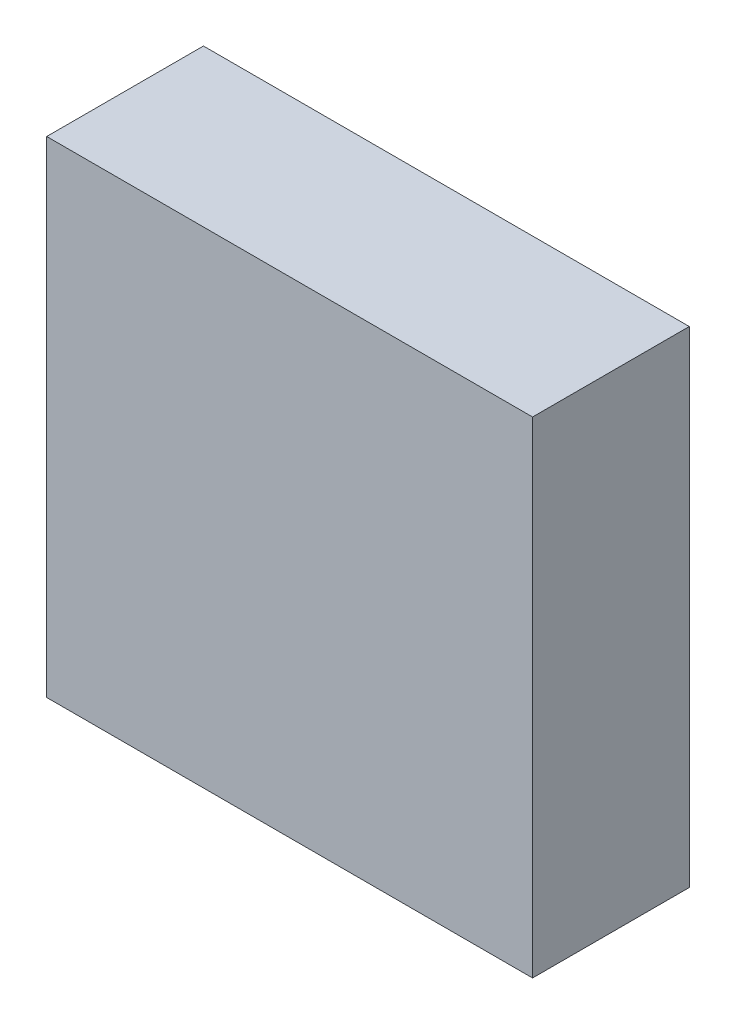
ISO-10303-21;
HEADER;
FILE_DESCRIPTION(('STEP AP214'),'2;1');
FILE_NAME('part.step','',(''),(''),'','','');
FILE_SCHEMA(('AUTOMOTIVE_DESIGN { 1 0 10303 214 1 1 1 1 }'));
ENDSEC;
DATA;
#1=APPLICATION_CONTEXT('core data for automotive mechanical design processes');
#2=APPLICATION_PROTOCOL_DEFINITION('international standard','automotive_design',2000,#1);
#3=PRODUCT_CONTEXT('',#1,'mechanical');
#4=PRODUCT('Part','Part','',(#3));
#5=PRODUCT_RELATED_PRODUCT_CATEGORY('part','',(#4));
#6=PRODUCT_DEFINITION_FORMATION('','',#4);
#7=PRODUCT_DEFINITION_CONTEXT('part definition',#1,'design');
#8=PRODUCT_DEFINITION('design','',#6,#7);
#9=PRODUCT_DEFINITION_SHAPE('','',#8);
#10=(LENGTH_UNIT() NAMED_UNIT(*) SI_UNIT(.MILLI.,.METRE.));
#11=(NAMED_UNIT(*) PLANE_ANGLE_UNIT() SI_UNIT($,.RADIAN.));
#12=(NAMED_UNIT(*) SI_UNIT($,.STERADIAN.) SOLID_ANGLE_UNIT());
#13=UNCERTAINTY_MEASURE_WITH_UNIT(LENGTH_MEASURE(1.E-05),#10,'distance_accuracy_value','');
#14=(GEOMETRIC_REPRESENTATION_CONTEXT(3) GLOBAL_UNCERTAINTY_ASSIGNED_CONTEXT((#13)) GLOBAL_UNIT_ASSIGNED_CONTEXT((#10,
#11,#12)) REPRESENTATION_CONTEXT('',''));
#15=CARTESIAN_POINT('',(0.,0.,0.));
#16=DIRECTION('',(0.,0.,1.));
#17=DIRECTION('',(1.,0.,0.));
#18=AXIS2_PLACEMENT_3D('',#15,#16,#17);
#19=CARTESIAN_POINT('',(-1.5500096,1.5500223,1.00000054));
#20=DIRECTION('',(0.,0.,1.));
#21=DIRECTION('',(1.,0.,0.));
#22=AXIS2_PLACEMENT_3D('',#19,#20,#21);
#23=PLANE('',#22);
#24=DIRECTION('',(0.,1.,0.));
#25=VECTOR('',#24,1.);
#26=CARTESIAN_POINT('',(-1.5500096,-1.5500223,1.00000054));
#27=LINE('',#26,#25);
#28=CARTESIAN_POINT('',(-1.5500096,-1.5500223,1.00000054));
#29=VERTEX_POINT('',#28);
#30=CARTESIAN_POINT('',(-1.5500096,1.5500223,1.00000054));
#31=VERTEX_POINT('',#30);
#32=EDGE_CURVE('E27',#29,#31,#27,.T.);
#33=ORIENTED_EDGE('',*,*,#32,.F.);
#34=DIRECTION('',(-0.999999999972811,-7.37414181615661E-06,0.));
#35=VECTOR('',#34,1.);
#36=CARTESIAN_POINT('',(1.55001214,-1.54999944,1.00000054));
#37=LINE('',#36,#35);
#38=CARTESIAN_POINT('',(1.55001214,-1.54999944,1.00000054));
#39=VERTEX_POINT('',#38);
#40=EDGE_CURVE('E69',#39,#29,#37,.T.);
#41=ORIENTED_EDGE('',*,*,#40,.F.);
#42=DIRECTION('',(7.37414185282961E-06,-0.999999999972811,0.));
#43=VECTOR('',#42,1.);
#44=CARTESIAN_POINT('',(1.54998928,1.5500223,1.00000054));
#45=LINE('',#44,#43);
#46=CARTESIAN_POINT('',(1.54998928,1.5500223,1.00000054));
#47=VERTEX_POINT('',#46);
#48=EDGE_CURVE('E72',#47,#39,#45,.T.);
#49=ORIENTED_EDGE('',*,*,#48,.F.);
#50=DIRECTION('',(1.,0.,0.));
#51=VECTOR('',#50,1.);
#52=CARTESIAN_POINT('',(-1.5500096,1.5500223,1.00000054));
#53=LINE('',#52,#51);
#54=EDGE_CURVE('E114',#31,#47,#53,.T.);
#55=ORIENTED_EDGE('',*,*,#54,.F.);
#56=EDGE_LOOP('',(#33,#41,#49,#55));
#57=FACE_BOUND('',#56,.T.);
#58=ADVANCED_FACE('F17',(#57),#23,.T.);
#59=CARTESIAN_POINT('',(-1.5500096,1.5500223,0.));
#60=DIRECTION('',(0.,0.,1.));
#61=DIRECTION('',(1.,0.,0.));
#62=AXIS2_PLACEMENT_3D('',#59,#60,#61);
#63=PLANE('',#62);
#64=DIRECTION('',(1.,0.,0.));
#65=VECTOR('',#64,1.);
#66=CARTESIAN_POINT('',(-1.5500096,1.5500223,0.));
#67=LINE('',#66,#65);
#68=CARTESIAN_POINT('',(-1.5500096,1.5500223,0.));
#69=VERTEX_POINT('',#68);
#70=CARTESIAN_POINT('',(1.54998928,1.5500223,0.));
#71=VERTEX_POINT('',#70);
#72=EDGE_CURVE('E92',#69,#71,#67,.T.);
#73=ORIENTED_EDGE('',*,*,#72,.T.);
#74=DIRECTION('',(7.37414185282961E-06,-0.999999999972811,0.));
#75=VECTOR('',#74,1.);
#76=CARTESIAN_POINT('',(1.54998928,1.5500223,0.));
#77=LINE('',#76,#75);
#78=CARTESIAN_POINT('',(1.55001214,-1.54999944,0.));
#79=VERTEX_POINT('',#78);
#80=EDGE_CURVE('E78',#71,#79,#77,.T.);
#81=ORIENTED_EDGE('',*,*,#80,.T.);
#82=DIRECTION('',(-0.999999999972811,-7.37414181615661E-06,0.));
#83=VECTOR('',#82,1.);
#84=CARTESIAN_POINT('',(1.55001214,-1.54999944,0.));
#85=LINE('',#84,#83);
#86=CARTESIAN_POINT('',(-1.5500096,-1.5500223,0.));
#87=VERTEX_POINT('',#86);
#88=EDGE_CURVE('E21',#79,#87,#85,.T.);
#89=ORIENTED_EDGE('',*,*,#88,.T.);
#90=DIRECTION('',(0.,1.,0.));
#91=VECTOR('',#90,1.);
#92=CARTESIAN_POINT('',(-1.5500096,-1.5500223,0.));
#93=LINE('',#92,#91);
#94=EDGE_CURVE('E11',#87,#69,#93,.T.);
#95=ORIENTED_EDGE('',*,*,#94,.T.);
#96=EDGE_LOOP('',(#73,#81,#89,#95));
#97=FACE_BOUND('',#96,.T.);
#98=ADVANCED_FACE('F123',(#97),#63,.F.);
#99=CARTESIAN_POINT('',(-1.5500096,-1.5500223,0.));
#100=DIRECTION('',(-1.,0.,0.));
#101=DIRECTION('',(0.,0.,1.));
#102=AXIS2_PLACEMENT_3D('',#99,#100,#101);
#103=PLANE('',#102);
#104=DIRECTION('',(0.,0.,1.));
#105=VECTOR('',#104,1.);
#106=CARTESIAN_POINT('',(-1.5500096,-1.5500223,0.));
#107=LINE('',#106,#105);
#108=EDGE_CURVE('E77',#87,#29,#107,.T.);
#109=ORIENTED_EDGE('',*,*,#108,.T.);
#110=ORIENTED_EDGE('',*,*,#32,.T.);
#111=DIRECTION('',(0.,0.,1.));
#112=VECTOR('',#111,1.);
#113=CARTESIAN_POINT('',(-1.5500096,1.5500223,0.));
#114=LINE('',#113,#112);
#115=EDGE_CURVE('E117',#69,#31,#114,.T.);
#116=ORIENTED_EDGE('',*,*,#115,.F.);
#117=ORIENTED_EDGE('',*,*,#94,.F.);
#118=EDGE_LOOP('',(#109,#110,#116,#117));
#119=FACE_BOUND('',#118,.T.);
#120=ADVANCED_FACE('F19',(#119),#103,.T.);
#121=CARTESIAN_POINT('',(1.55001214,-1.54999944,0.));
#122=DIRECTION('',(7.37414181615661E-06,-0.999999999972811,0.));
#123=DIRECTION('',(0.,0.,-1.));
#124=AXIS2_PLACEMENT_3D('',#121,#122,#123);
#125=PLANE('',#124);
#126=DIRECTION('',(0.,0.,1.));
#127=VECTOR('',#126,1.);
#128=CARTESIAN_POINT('',(1.55001214,-1.54999944,0.));
#129=LINE('',#128,#127);
#130=EDGE_CURVE('E81',#79,#39,#129,.T.);
#131=ORIENTED_EDGE('',*,*,#130,.T.);
#132=ORIENTED_EDGE('',*,*,#40,.T.);
#133=ORIENTED_EDGE('',*,*,#108,.F.);
#134=ORIENTED_EDGE('',*,*,#88,.F.);
#135=EDGE_LOOP('',(#131,#132,#133,#134));
#136=FACE_BOUND('',#135,.T.);
#137=ADVANCED_FACE('F82',(#136),#125,.T.);
#138=CARTESIAN_POINT('',(1.54998928,1.5500223,0.));
#139=DIRECTION('',(0.999999999972811,7.37414185282961E-06,0.));
#140=DIRECTION('',(0.,0.,-1.));
#141=AXIS2_PLACEMENT_3D('',#138,#139,#140);
#142=PLANE('',#141);
#143=DIRECTION('',(0.,0.,1.));
#144=VECTOR('',#143,1.);
#145=CARTESIAN_POINT('',(1.54998928,1.5500223,0.));
#146=LINE('',#145,#144);
#147=EDGE_CURVE('E89',#71,#47,#146,.T.);
#148=ORIENTED_EDGE('',*,*,#147,.T.);
#149=ORIENTED_EDGE('',*,*,#48,.T.);
#150=ORIENTED_EDGE('',*,*,#130,.F.);
#151=ORIENTED_EDGE('',*,*,#80,.F.);
#152=EDGE_LOOP('',(#148,#149,#150,#151));
#153=FACE_BOUND('',#152,.T.);
#154=ADVANCED_FACE('F87',(#153),#142,.T.);
#155=CARTESIAN_POINT('',(-1.5500096,1.5500223,0.));
#156=DIRECTION('',(0.,1.,0.));
#157=DIRECTION('',(1.,0.,0.));
#158=AXIS2_PLACEMENT_3D('',#155,#156,#157);
#159=PLANE('',#158);
#160=ORIENTED_EDGE('',*,*,#115,.T.);
#161=ORIENTED_EDGE('',*,*,#54,.T.);
#162=ORIENTED_EDGE('',*,*,#147,.F.);
#163=ORIENTED_EDGE('',*,*,#72,.F.);
#164=EDGE_LOOP('',(#160,#161,#162,#163));
#165=FACE_BOUND('',#164,.T.);
#166=ADVANCED_FACE('F126',(#165),#159,.T.);
#167=CLOSED_SHELL('',(#58,#98,#120,#137,#154,#166));
#168=MANIFOLD_SOLID_BREP('B1',#167);
#169=ADVANCED_BREP_SHAPE_REPRESENTATION('',(#18,#168),#14);
#170=SHAPE_DEFINITION_REPRESENTATION(#9,#169);
ENDSEC;
END-ISO-10303-21;
